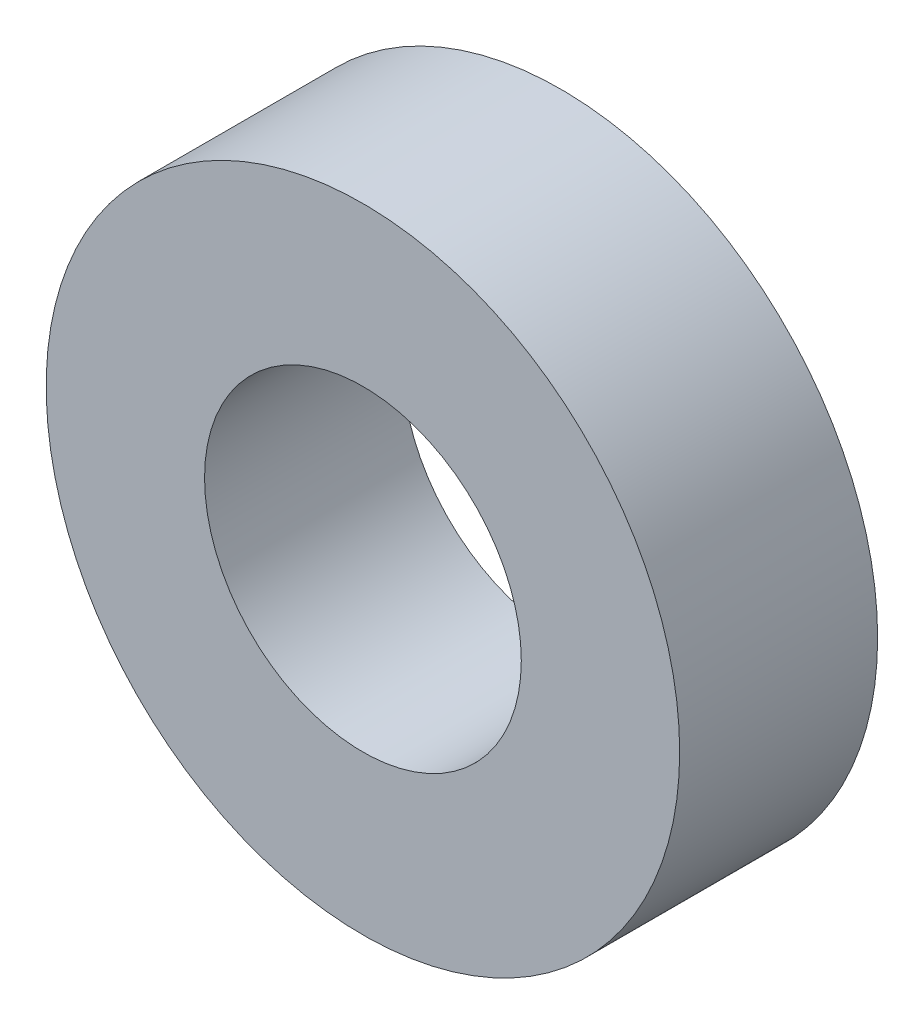
ISO-10303-21;
HEADER;
FILE_DESCRIPTION(('STEP AP214'),'2;1');
FILE_NAME('part.step','',(''),(''),'','','');
FILE_SCHEMA(('AUTOMOTIVE_DESIGN { 1 0 10303 214 1 1 1 1 }'));
ENDSEC;
DATA;
#1=APPLICATION_CONTEXT('core data for automotive mechanical design processes');
#2=APPLICATION_PROTOCOL_DEFINITION('international standard','automotive_design',2000,#1);
#3=PRODUCT_CONTEXT('',#1,'mechanical');
#4=PRODUCT('Part','Part','',(#3));
#5=PRODUCT_RELATED_PRODUCT_CATEGORY('part','',(#4));
#6=PRODUCT_DEFINITION_FORMATION('','',#4);
#7=PRODUCT_DEFINITION_CONTEXT('part definition',#1,'design');
#8=PRODUCT_DEFINITION('design','',#6,#7);
#9=PRODUCT_DEFINITION_SHAPE('','',#8);
#10=(LENGTH_UNIT() NAMED_UNIT(*) SI_UNIT(.MILLI.,.METRE.));
#11=(NAMED_UNIT(*) PLANE_ANGLE_UNIT() SI_UNIT($,.RADIAN.));
#12=(NAMED_UNIT(*) SI_UNIT($,.STERADIAN.) SOLID_ANGLE_UNIT());
#13=UNCERTAINTY_MEASURE_WITH_UNIT(LENGTH_MEASURE(1.E-05),#10,'distance_accuracy_value','');
#14=(GEOMETRIC_REPRESENTATION_CONTEXT(3) GLOBAL_UNCERTAINTY_ASSIGNED_CONTEXT((#13)) GLOBAL_UNIT_ASSIGNED_CONTEXT((#10,
#11,#12)) REPRESENTATION_CONTEXT('',''));
#15=CARTESIAN_POINT('',(0.,0.,0.));
#16=DIRECTION('',(0.,0.,1.));
#17=DIRECTION('',(1.,0.,0.));
#18=AXIS2_PLACEMENT_3D('',#15,#16,#17);
#19=CARTESIAN_POINT('',(0.,0.,5.));
#20=DIRECTION('',(0.,0.,1.));
#21=DIRECTION('',(1.,0.,0.));
#22=AXIS2_PLACEMENT_3D('',#19,#20,#21);
#23=PLANE('',#22);
#24=CARTESIAN_POINT('',(0.,0.,5.));
#25=DIRECTION('',(0.,0.,1.));
#26=DIRECTION('',(1.,0.,0.));
#27=AXIS2_PLACEMENT_3D('',#24,#25,#26);
#28=CIRCLE('',#27,8.);
#29=CARTESIAN_POINT('',(8.,0.,5.));
#30=VERTEX_POINT('',#29);
#31=EDGE_CURVE('E10',#30,#30,#28,.T.);
#32=ORIENTED_EDGE('',*,*,#31,.T.);
#33=EDGE_LOOP('',(#32));
#34=FACE_BOUND('',#33,.T.);
#35=CARTESIAN_POINT('',(0.,0.,5.));
#36=DIRECTION('',(0.,0.,1.));
#37=DIRECTION('',(1.,0.,0.));
#38=AXIS2_PLACEMENT_3D('',#35,#36,#37);
#39=CIRCLE('',#38,4.);
#40=CARTESIAN_POINT('',(4.,0.,5.));
#41=VERTEX_POINT('',#40);
#42=EDGE_CURVE('E43',#41,#41,#39,.T.);
#43=ORIENTED_EDGE('',*,*,#42,.F.);
#44=EDGE_LOOP('',(#43));
#45=FACE_BOUND('',#44,.T.);
#46=ADVANCED_FACE('F32',(#34,#45),#23,.T.);
#47=CARTESIAN_POINT('',(0.,0.,0.));
#48=DIRECTION('',(0.,0.,1.));
#49=DIRECTION('',(1.,0.,0.));
#50=AXIS2_PLACEMENT_3D('',#47,#48,#49);
#51=PLANE('',#50);
#52=CARTESIAN_POINT('',(0.,0.,0.));
#53=DIRECTION('',(0.,0.,1.));
#54=DIRECTION('',(1.,0.,0.));
#55=AXIS2_PLACEMENT_3D('',#52,#53,#54);
#56=CIRCLE('',#55,8.);
#57=CARTESIAN_POINT('',(8.,0.,0.));
#58=VERTEX_POINT('',#57);
#59=EDGE_CURVE('E36',#58,#58,#56,.T.);
#60=ORIENTED_EDGE('',*,*,#59,.F.);
#61=EDGE_LOOP('',(#60));
#62=FACE_BOUND('',#61,.T.);
#63=CARTESIAN_POINT('',(0.,0.,0.));
#64=DIRECTION('',(0.,0.,1.));
#65=DIRECTION('',(1.,0.,0.));
#66=AXIS2_PLACEMENT_3D('',#63,#64,#65);
#67=CIRCLE('',#66,4.);
#68=CARTESIAN_POINT('',(4.,0.,0.));
#69=VERTEX_POINT('',#68);
#70=EDGE_CURVE('E45',#69,#69,#67,.T.);
#71=ORIENTED_EDGE('',*,*,#70,.T.);
#72=EDGE_LOOP('',(#71));
#73=FACE_BOUND('',#72,.T.);
#74=ADVANCED_FACE('F55',(#62,#73),#51,.F.);
#75=CARTESIAN_POINT('',(0.,0.,5.));
#76=DIRECTION('',(0.,0.,-1.));
#77=DIRECTION('',(-1.,0.,0.));
#78=AXIS2_PLACEMENT_3D('',#75,#76,#77);
#79=CYLINDRICAL_SURFACE('',#78,8.);
#80=ORIENTED_EDGE('',*,*,#31,.F.);
#81=EDGE_LOOP('',(#80));
#82=FACE_BOUND('',#81,.T.);
#83=ORIENTED_EDGE('',*,*,#59,.T.);
#84=EDGE_LOOP('',(#83));
#85=FACE_BOUND('',#84,.T.);
#86=ADVANCED_FACE('F34',(#82,#85),#79,.T.);
#87=CARTESIAN_POINT('',(0.,0.,5.));
#88=DIRECTION('',(0.,0.,-1.));
#89=DIRECTION('',(-1.,0.,0.));
#90=AXIS2_PLACEMENT_3D('',#87,#88,#89);
#91=CYLINDRICAL_SURFACE('',#90,4.);
#92=ORIENTED_EDGE('',*,*,#42,.T.);
#93=EDGE_LOOP('',(#92));
#94=FACE_BOUND('',#93,.T.);
#95=ORIENTED_EDGE('',*,*,#70,.F.);
#96=EDGE_LOOP('',(#95));
#97=FACE_BOUND('',#96,.T.);
#98=ADVANCED_FACE('F51',(#94,#97),#91,.F.);
#99=CLOSED_SHELL('',(#46,#74,#86,#98));
#100=MANIFOLD_SOLID_BREP('B2',#99);
#101=ADVANCED_BREP_SHAPE_REPRESENTATION('',(#18,#100),#14);
#102=SHAPE_DEFINITION_REPRESENTATION(#9,#101);
ENDSEC;
END-ISO-10303-21;
